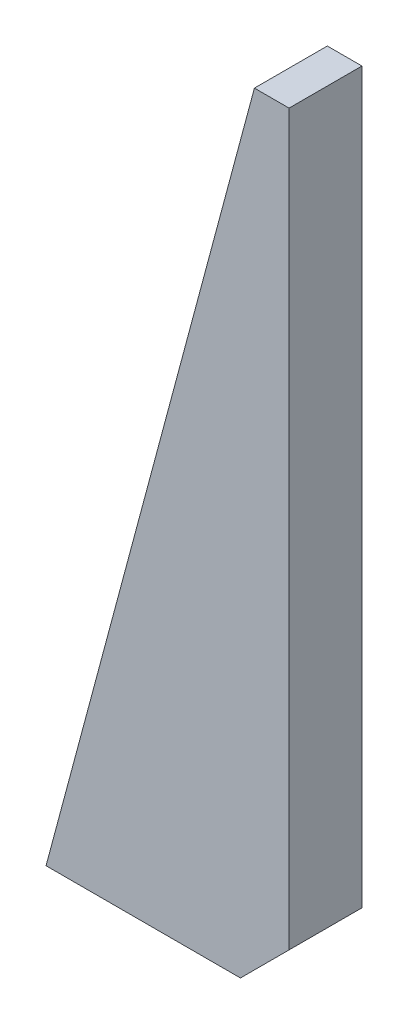
ISO-10303-21;
HEADER;
FILE_DESCRIPTION(('STEP AP214'),'2;1');
FILE_NAME('part.step','',(''),(''),'','','');
FILE_SCHEMA(('AUTOMOTIVE_DESIGN { 1 0 10303 214 1 1 1 1 }'));
ENDSEC;
DATA;
#1=APPLICATION_CONTEXT('core data for automotive mechanical design processes');
#2=APPLICATION_PROTOCOL_DEFINITION('international standard','automotive_design',2000,#1);
#3=PRODUCT_CONTEXT('',#1,'mechanical');
#4=PRODUCT('Part','Part','',(#3));
#5=PRODUCT_RELATED_PRODUCT_CATEGORY('part','',(#4));
#6=PRODUCT_DEFINITION_FORMATION('','',#4);
#7=PRODUCT_DEFINITION_CONTEXT('part definition',#1,'design');
#8=PRODUCT_DEFINITION('design','',#6,#7);
#9=PRODUCT_DEFINITION_SHAPE('','',#8);
#10=(LENGTH_UNIT() NAMED_UNIT(*) SI_UNIT(.MILLI.,.METRE.));
#11=(NAMED_UNIT(*) PLANE_ANGLE_UNIT() SI_UNIT($,.RADIAN.));
#12=(NAMED_UNIT(*) SI_UNIT($,.STERADIAN.) SOLID_ANGLE_UNIT());
#13=UNCERTAINTY_MEASURE_WITH_UNIT(LENGTH_MEASURE(1.E-05),#10,'distance_accuracy_value','');
#14=(GEOMETRIC_REPRESENTATION_CONTEXT(3) GLOBAL_UNCERTAINTY_ASSIGNED_CONTEXT((#13)) GLOBAL_UNIT_ASSIGNED_CONTEXT((#10,
#11,#12)) REPRESENTATION_CONTEXT('',''));
#15=CARTESIAN_POINT('',(0.,0.,0.));
#16=DIRECTION('',(0.,0.,1.));
#17=DIRECTION('',(1.,0.,0.));
#18=AXIS2_PLACEMENT_3D('',#15,#16,#17);
#19=CARTESIAN_POINT('',(-50.,-80.,7.5));
#20=DIRECTION('',(0.965925826289069,-0.258819045102518,0.));
#21=DIRECTION('',(0.258819045102518,0.965925826289069,0.));
#22=AXIS2_PLACEMENT_3D('',#19,#20,#21);
#23=PLANE('',#22);
#24=DIRECTION('',(-0.258819045102518,-0.965925826289069,0.));
#25=VECTOR('',#24,1.);
#26=CARTESIAN_POINT('',(-50.,-80.,-7.5));
#27=LINE('',#26,#25);
#28=CARTESIAN_POINT('',(-7.12812921102088,80.,-7.5));
#29=VERTEX_POINT('',#28);
#30=CARTESIAN_POINT('',(-50.,-80.,-7.5));
#31=VERTEX_POINT('',#30);
#32=EDGE_CURVE('E107',#29,#31,#27,.T.);
#33=ORIENTED_EDGE('',*,*,#32,.T.);
#34=DIRECTION('',(0.,0.,-1.));
#35=VECTOR('',#34,1.);
#36=CARTESIAN_POINT('',(-50.,-80.,7.5));
#37=LINE('',#36,#35);
#38=CARTESIAN_POINT('',(-50.,-80.,7.5));
#39=VERTEX_POINT('',#38);
#40=EDGE_CURVE('E11',#39,#31,#37,.T.);
#41=ORIENTED_EDGE('',*,*,#40,.F.);
#42=DIRECTION('',(-0.258819045102518,-0.965925826289069,0.));
#43=VECTOR('',#42,1.);
#44=CARTESIAN_POINT('',(-50.,-80.,7.5));
#45=LINE('',#44,#43);
#46=CARTESIAN_POINT('',(-7.12812921102088,80.,7.5));
#47=VERTEX_POINT('',#46);
#48=EDGE_CURVE('E115',#47,#39,#45,.T.);
#49=ORIENTED_EDGE('',*,*,#48,.F.);
#50=DIRECTION('',(0.,0.,-1.));
#51=VECTOR('',#50,1.);
#52=CARTESIAN_POINT('',(-7.12812921102088,80.,7.5));
#53=LINE('',#52,#51);
#54=EDGE_CURVE('E103',#47,#29,#53,.T.);
#55=ORIENTED_EDGE('',*,*,#54,.T.);
#56=EDGE_LOOP('',(#33,#41,#49,#55));
#57=FACE_BOUND('',#56,.T.);
#58=ADVANCED_FACE('F33',(#57),#23,.F.);
#59=CARTESIAN_POINT('',(-10.,-80.,7.5));
#60=DIRECTION('',(0.,1.,0.));
#61=DIRECTION('',(0.,0.,1.));
#62=AXIS2_PLACEMENT_3D('',#59,#60,#61);
#63=PLANE('',#62);
#64=DIRECTION('',(1.,0.,0.));
#65=VECTOR('',#64,1.);
#66=CARTESIAN_POINT('',(-10.,-80.,-7.5));
#67=LINE('',#66,#65);
#68=CARTESIAN_POINT('',(-10.,-80.,-7.5));
#69=VERTEX_POINT('',#68);
#70=EDGE_CURVE('E110',#31,#69,#67,.T.);
#71=ORIENTED_EDGE('',*,*,#70,.T.);
#72=DIRECTION('',(0.,0.,-1.));
#73=VECTOR('',#72,1.);
#74=CARTESIAN_POINT('',(-10.,-80.,7.5));
#75=LINE('',#74,#73);
#76=CARTESIAN_POINT('',(-10.,-80.,7.5));
#77=VERTEX_POINT('',#76);
#78=EDGE_CURVE('E41',#77,#69,#75,.T.);
#79=ORIENTED_EDGE('',*,*,#78,.F.);
#80=DIRECTION('',(1.,0.,0.));
#81=VECTOR('',#80,1.);
#82=CARTESIAN_POINT('',(-10.,-80.,7.5));
#83=LINE('',#82,#81);
#84=EDGE_CURVE('E83',#39,#77,#83,.T.);
#85=ORIENTED_EDGE('',*,*,#84,.F.);
#86=ORIENTED_EDGE('',*,*,#40,.T.);
#87=EDGE_LOOP('',(#71,#79,#85,#86));
#88=FACE_BOUND('',#87,.T.);
#89=ADVANCED_FACE('F134',(#88),#63,.F.);
#90=CARTESIAN_POINT('',(0.,-70.,7.5));
#91=DIRECTION('',(-0.707106781186547,0.707106781186548,0.));
#92=DIRECTION('',(-0.707106781186548,-0.707106781186547,0.));
#93=AXIS2_PLACEMENT_3D('',#90,#91,#92);
#94=PLANE('',#93);
#95=DIRECTION('',(0.707106781186548,0.707106781186547,0.));
#96=VECTOR('',#95,1.);
#97=CARTESIAN_POINT('',(0.,-70.,-7.5));
#98=LINE('',#97,#96);
#99=CARTESIAN_POINT('',(0.,-70.,-7.5));
#100=VERTEX_POINT('',#99);
#101=EDGE_CURVE('E98',#69,#100,#98,.T.);
#102=ORIENTED_EDGE('',*,*,#101,.T.);
#103=DIRECTION('',(0.,0.,-1.));
#104=VECTOR('',#103,1.);
#105=CARTESIAN_POINT('',(0.,-70.,7.5));
#106=LINE('',#105,#104);
#107=CARTESIAN_POINT('',(0.,-70.,7.5));
#108=VERTEX_POINT('',#107);
#109=EDGE_CURVE('E95',#108,#100,#106,.T.);
#110=ORIENTED_EDGE('',*,*,#109,.F.);
#111=DIRECTION('',(0.707106781186548,0.707106781186547,0.));
#112=VECTOR('',#111,1.);
#113=CARTESIAN_POINT('',(0.,-70.,7.5));
#114=LINE('',#113,#112);
#115=EDGE_CURVE('E87',#77,#108,#114,.T.);
#116=ORIENTED_EDGE('',*,*,#115,.F.);
#117=ORIENTED_EDGE('',*,*,#78,.T.);
#118=EDGE_LOOP('',(#102,#110,#116,#117));
#119=FACE_BOUND('',#118,.T.);
#120=ADVANCED_FACE('F96',(#119),#94,.F.);
#121=CARTESIAN_POINT('',(0.,80.,7.5));
#122=DIRECTION('',(-1.,0.,0.));
#123=DIRECTION('',(0.,0.,1.));
#124=AXIS2_PLACEMENT_3D('',#121,#122,#123);
#125=PLANE('',#124);
#126=DIRECTION('',(0.,1.,0.));
#127=VECTOR('',#126,1.);
#128=CARTESIAN_POINT('',(0.,80.,-7.5));
#129=LINE('',#128,#127);
#130=CARTESIAN_POINT('',(0.,80.,-7.5));
#131=VERTEX_POINT('',#130);
#132=EDGE_CURVE('E69',#100,#131,#129,.T.);
#133=ORIENTED_EDGE('',*,*,#132,.T.);
#134=DIRECTION('',(0.,0.,-1.));
#135=VECTOR('',#134,1.);
#136=CARTESIAN_POINT('',(0.,80.,7.5));
#137=LINE('',#136,#135);
#138=CARTESIAN_POINT('',(0.,80.,7.5));
#139=VERTEX_POINT('',#138);
#140=EDGE_CURVE('E99',#139,#131,#137,.T.);
#141=ORIENTED_EDGE('',*,*,#140,.F.);
#142=DIRECTION('',(0.,1.,0.));
#143=VECTOR('',#142,1.);
#144=CARTESIAN_POINT('',(0.,80.,7.5));
#145=LINE('',#144,#143);
#146=EDGE_CURVE('E91',#108,#139,#145,.T.);
#147=ORIENTED_EDGE('',*,*,#146,.F.);
#148=ORIENTED_EDGE('',*,*,#109,.T.);
#149=EDGE_LOOP('',(#133,#141,#147,#148));
#150=FACE_BOUND('',#149,.T.);
#151=ADVANCED_FACE('F101',(#150),#125,.F.);
#152=CARTESIAN_POINT('',(0.,80.,7.5));
#153=DIRECTION('',(0.,-1.,0.));
#154=DIRECTION('',(0.,0.,-1.));
#155=AXIS2_PLACEMENT_3D('',#152,#153,#154);
#156=PLANE('',#155);
#157=DIRECTION('',(-1.,0.,0.));
#158=VECTOR('',#157,1.);
#159=CARTESIAN_POINT('',(0.,80.,-7.5));
#160=LINE('',#159,#158);
#161=EDGE_CURVE('E75',#131,#29,#160,.T.);
#162=ORIENTED_EDGE('',*,*,#161,.T.);
#163=ORIENTED_EDGE('',*,*,#54,.F.);
#164=DIRECTION('',(-1.,0.,0.));
#165=VECTOR('',#164,1.);
#166=CARTESIAN_POINT('',(0.,80.,7.5));
#167=LINE('',#166,#165);
#168=EDGE_CURVE('E49',#139,#47,#167,.T.);
#169=ORIENTED_EDGE('',*,*,#168,.F.);
#170=ORIENTED_EDGE('',*,*,#140,.T.);
#171=EDGE_LOOP('',(#162,#163,#169,#170));
#172=FACE_BOUND('',#171,.T.);
#173=ADVANCED_FACE('F123',(#172),#156,.F.);
#174=CARTESIAN_POINT('',(0.,0.,7.5));
#175=DIRECTION('',(0.,0.,1.));
#176=DIRECTION('',(1.,0.,0.));
#177=AXIS2_PLACEMENT_3D('',#174,#175,#176);
#178=PLANE('',#177);
#179=ORIENTED_EDGE('',*,*,#48,.T.);
#180=ORIENTED_EDGE('',*,*,#84,.T.);
#181=ORIENTED_EDGE('',*,*,#115,.T.);
#182=ORIENTED_EDGE('',*,*,#146,.T.);
#183=ORIENTED_EDGE('',*,*,#168,.T.);
#184=EDGE_LOOP('',(#179,#180,#181,#182,#183));
#185=FACE_BOUND('',#184,.T.);
#186=ADVANCED_FACE('F89',(#185),#178,.T.);
#187=CARTESIAN_POINT('',(0.,0.,-7.5));
#188=DIRECTION('',(0.,0.,1.));
#189=DIRECTION('',(1.,0.,0.));
#190=AXIS2_PLACEMENT_3D('',#187,#188,#189);
#191=PLANE('',#190);
#192=ORIENTED_EDGE('',*,*,#32,.F.);
#193=ORIENTED_EDGE('',*,*,#161,.F.);
#194=ORIENTED_EDGE('',*,*,#132,.F.);
#195=ORIENTED_EDGE('',*,*,#101,.F.);
#196=ORIENTED_EDGE('',*,*,#70,.F.);
#197=EDGE_LOOP('',(#192,#193,#194,#195,#196));
#198=FACE_BOUND('',#197,.T.);
#199=ADVANCED_FACE('F119',(#198),#191,.F.);
#200=CLOSED_SHELL('',(#58,#89,#120,#151,#173,#186,#199));
#201=MANIFOLD_SOLID_BREP('B2',#200);
#202=ADVANCED_BREP_SHAPE_REPRESENTATION('',(#18,#201),#14);
#203=SHAPE_DEFINITION_REPRESENTATION(#9,#202);
ENDSEC;
END-ISO-10303-21;
